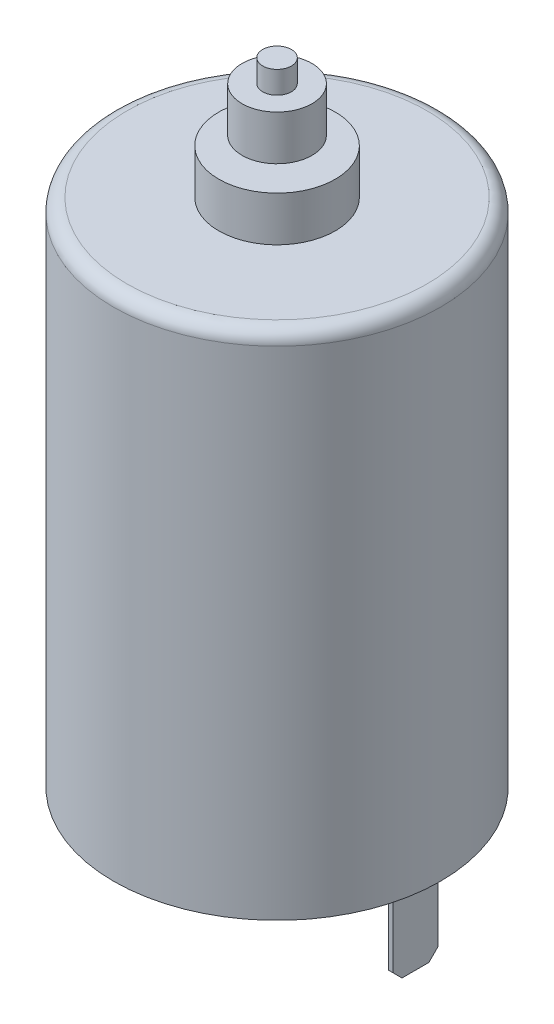
ISO-10303-21;
HEADER;
FILE_DESCRIPTION(('STEP AP214'),'2;1');
FILE_NAME('part.step','',(''),(''),'','','');
FILE_SCHEMA(('AUTOMOTIVE_DESIGN { 1 0 10303 214 1 1 1 1 }'));
ENDSEC;
DATA;
#1=APPLICATION_CONTEXT('core data for automotive mechanical design processes');
#2=APPLICATION_PROTOCOL_DEFINITION('international standard','automotive_design',2000,#1);
#3=PRODUCT_CONTEXT('',#1,'mechanical');
#4=PRODUCT('Part','Part','',(#3));
#5=PRODUCT_RELATED_PRODUCT_CATEGORY('part','',(#4));
#6=PRODUCT_DEFINITION_FORMATION('','',#4);
#7=PRODUCT_DEFINITION_CONTEXT('part definition',#1,'design');
#8=PRODUCT_DEFINITION('design','',#6,#7);
#9=PRODUCT_DEFINITION_SHAPE('','',#8);
#10=(LENGTH_UNIT() NAMED_UNIT(*) SI_UNIT(.MILLI.,.METRE.));
#11=(NAMED_UNIT(*) PLANE_ANGLE_UNIT() SI_UNIT($,.RADIAN.));
#12=(NAMED_UNIT(*) SI_UNIT($,.STERADIAN.) SOLID_ANGLE_UNIT());
#13=UNCERTAINTY_MEASURE_WITH_UNIT(LENGTH_MEASURE(1.E-05),#10,'distance_accuracy_value','');
#14=(GEOMETRIC_REPRESENTATION_CONTEXT(3) GLOBAL_UNCERTAINTY_ASSIGNED_CONTEXT((#13)) GLOBAL_UNIT_ASSIGNED_CONTEXT((#10,
#11,#12)) REPRESENTATION_CONTEXT('',''));
#15=CARTESIAN_POINT('',(0.,0.,0.));
#16=DIRECTION('',(0.,0.,1.));
#17=DIRECTION('',(1.,0.,0.));
#18=AXIS2_PLACEMENT_3D('',#15,#16,#17);
#19=CARTESIAN_POINT('',(0.,0.,0.));
#20=DIRECTION('',(0.,1.,0.));
#21=DIRECTION('',(0.,0.,1.));
#22=AXIS2_PLACEMENT_3D('',#19,#20,#21);
#23=PLANE('',#22);
#24=DIRECTION('',(0.,0.,-1.));
#25=VECTOR('',#24,1.);
#26=CARTESIAN_POINT('',(14.95,0.,2.5));
#27=LINE('',#26,#25);
#28=CARTESIAN_POINT('',(14.95,0.,2.5));
#29=VERTEX_POINT('',#28);
#30=CARTESIAN_POINT('',(14.95,0.,-2.5));
#31=VERTEX_POINT('',#30);
#32=EDGE_CURVE('E158',#29,#31,#27,.T.);
#33=ORIENTED_EDGE('',*,*,#32,.F.);
#34=DIRECTION('',(-1.,0.,0.));
#35=VECTOR('',#34,1.);
#36=CARTESIAN_POINT('',(15.45,0.,2.5));
#37=LINE('',#36,#35);
#38=CARTESIAN_POINT('',(15.45,0.,2.5));
#39=VERTEX_POINT('',#38);
#40=EDGE_CURVE('E163',#39,#29,#37,.T.);
#41=ORIENTED_EDGE('',*,*,#40,.F.);
#42=DIRECTION('',(0.,0.,1.));
#43=VECTOR('',#42,1.);
#44=CARTESIAN_POINT('',(15.45,0.,2.5));
#45=LINE('',#44,#43);
#46=CARTESIAN_POINT('',(15.45,0.,-2.5));
#47=VERTEX_POINT('',#46);
#48=EDGE_CURVE('E172',#47,#39,#45,.T.);
#49=ORIENTED_EDGE('',*,*,#48,.F.);
#50=DIRECTION('',(1.,0.,0.));
#51=VECTOR('',#50,1.);
#52=CARTESIAN_POINT('',(15.45,0.,-2.5));
#53=LINE('',#52,#51);
#54=EDGE_CURVE('E169',#31,#47,#53,.T.);
#55=ORIENTED_EDGE('',*,*,#54,.F.);
#56=EDGE_LOOP('',(#33,#41,#49,#55));
#57=FACE_BOUND('',#56,.T.);
#58=CARTESIAN_POINT('',(0.,0.,0.));
#59=DIRECTION('',(0.,-1.,0.));
#60=DIRECTION('',(0.,0.,-1.));
#61=AXIS2_PLACEMENT_3D('',#58,#59,#60);
#62=CIRCLE('',#61,5.);
#63=CARTESIAN_POINT('',(0.,0.,-5.));
#64=VERTEX_POINT('',#63);
#65=EDGE_CURVE('E192',#64,#64,#62,.T.);
#66=ORIENTED_EDGE('',*,*,#65,.F.);
#67=EDGE_LOOP('',(#66));
#68=FACE_BOUND('',#67,.T.);
#69=CARTESIAN_POINT('',(0.,0.,0.));
#70=DIRECTION('',(0.,1.,0.));
#71=DIRECTION('',(0.,0.,1.));
#72=AXIS2_PLACEMENT_3D('',#69,#70,#71);
#73=CIRCLE('',#72,18.25);
#74=CARTESIAN_POINT('',(0.,0.,18.25));
#75=VERTEX_POINT('',#74);
#76=EDGE_CURVE('E215',#75,#75,#73,.T.);
#77=ORIENTED_EDGE('',*,*,#76,.F.);
#78=EDGE_LOOP('',(#77));
#79=FACE_BOUND('',#78,.T.);
#80=DIRECTION('',(0.,0.,-1.));
#81=VECTOR('',#80,1.);
#82=CARTESIAN_POINT('',(-15.45,0.,2.5));
#83=LINE('',#82,#81);
#84=CARTESIAN_POINT('',(-15.45,0.,2.5));
#85=VERTEX_POINT('',#84);
#86=CARTESIAN_POINT('',(-15.45,0.,-2.5));
#87=VERTEX_POINT('',#86);
#88=EDGE_CURVE('E126',#85,#87,#83,.T.);
#89=ORIENTED_EDGE('',*,*,#88,.F.);
#90=DIRECTION('',(-1.,0.,0.));
#91=VECTOR('',#90,1.);
#92=CARTESIAN_POINT('',(-15.45,0.,2.5));
#93=LINE('',#92,#91);
#94=CARTESIAN_POINT('',(-14.95,0.,2.5));
#95=VERTEX_POINT('',#94);
#96=EDGE_CURVE('E138',#95,#85,#93,.T.);
#97=ORIENTED_EDGE('',*,*,#96,.F.);
#98=DIRECTION('',(0.,0.,1.));
#99=VECTOR('',#98,1.);
#100=CARTESIAN_POINT('',(-14.95,0.,2.5));
#101=LINE('',#100,#99);
#102=CARTESIAN_POINT('',(-14.95,0.,-2.5));
#103=VERTEX_POINT('',#102);
#104=EDGE_CURVE('E146',#103,#95,#101,.T.);
#105=ORIENTED_EDGE('',*,*,#104,.F.);
#106=DIRECTION('',(1.,0.,0.));
#107=VECTOR('',#106,1.);
#108=CARTESIAN_POINT('',(-15.45,0.,-2.5));
#109=LINE('',#108,#107);
#110=EDGE_CURVE('E141',#87,#103,#109,.T.);
#111=ORIENTED_EDGE('',*,*,#110,.F.);
#112=EDGE_LOOP('',(#89,#97,#105,#111));
#113=FACE_BOUND('',#112,.T.);
#114=ADVANCED_FACE('F32',(#57,#68,#79,#113),#23,.F.);
#115=CARTESIAN_POINT('',(0.,70.5,0.));
#116=DIRECTION('',(0.,-1.,0.));
#117=DIRECTION('',(0.,0.,-1.));
#118=AXIS2_PLACEMENT_3D('',#115,#116,#117);
#119=CYLINDRICAL_SURFACE('',#118,1.6);
#120=CARTESIAN_POINT('',(0.,62.,0.));
#121=DIRECTION('',(0.,1.,0.));
#122=DIRECTION('',(0.,0.,1.));
#123=AXIS2_PLACEMENT_3D('',#120,#121,#122);
#124=CIRCLE('',#123,1.6);
#125=CARTESIAN_POINT('',(0.,62.,1.6));
#126=VERTEX_POINT('',#125);
#127=EDGE_CURVE('E209',#126,#126,#124,.T.);
#128=ORIENTED_EDGE('',*,*,#127,.T.);
#129=EDGE_LOOP('',(#128));
#130=FACE_BOUND('',#129,.T.);
#131=CARTESIAN_POINT('',(0.,63.,0.));
#132=DIRECTION('',(0.,1.,0.));
#133=DIRECTION('',(0.,0.,1.));
#134=AXIS2_PLACEMENT_3D('',#131,#132,#133);
#135=CIRCLE('',#134,1.6);
#136=CARTESIAN_POINT('',(0.,63.,1.6));
#137=VERTEX_POINT('',#136);
#138=EDGE_CURVE('E198',#137,#137,#135,.T.);
#139=ORIENTED_EDGE('',*,*,#138,.F.);
#140=EDGE_LOOP('',(#139));
#141=FACE_BOUND('',#140,.T.);
#142=ADVANCED_FACE('F287',(#130,#141),#119,.T.);
#143=CARTESIAN_POINT('',(0.,57.,0.));
#144=DIRECTION('',(0.,-1.,0.));
#145=DIRECTION('',(0.,0.,-1.));
#146=AXIS2_PLACEMENT_3D('',#143,#144,#145);
#147=CYLINDRICAL_SURFACE('',#146,18.25);
#148=CARTESIAN_POINT('',(0.,55.5,0.));
#149=DIRECTION('',(0.,1.,0.));
#150=DIRECTION('',(0.,0.,1.));
#151=AXIS2_PLACEMENT_3D('',#148,#149,#150);
#152=CIRCLE('',#151,18.25);
#153=CARTESIAN_POINT('',(0.,55.5,18.25));
#154=VERTEX_POINT('',#153);
#155=EDGE_CURVE('E212',#154,#154,#152,.F.);
#156=ORIENTED_EDGE('',*,*,#155,.T.);
#157=EDGE_LOOP('',(#156));
#158=FACE_BOUND('',#157,.T.);
#159=ORIENTED_EDGE('',*,*,#76,.T.);
#160=EDGE_LOOP('',(#159));
#161=FACE_BOUND('',#160,.T.);
#162=ADVANCED_FACE('F292',(#158,#161),#147,.T.);
#163=CARTESIAN_POINT('',(0.,57.,0.));
#164=DIRECTION('',(0.,1.,0.));
#165=DIRECTION('',(0.,0.,1.));
#166=AXIS2_PLACEMENT_3D('',#163,#164,#165);
#167=PLANE('',#166);
#168=CARTESIAN_POINT('',(0.,57.,0.));
#169=DIRECTION('',(0.,1.,0.));
#170=DIRECTION('',(0.,0.,1.));
#171=AXIS2_PLACEMENT_3D('',#168,#169,#170);
#172=CIRCLE('',#171,16.75);
#173=CARTESIAN_POINT('',(0.,57.,16.75));
#174=VERTEX_POINT('',#173);
#175=EDGE_CURVE('E219',#174,#174,#172,.T.);
#176=ORIENTED_EDGE('',*,*,#175,.T.);
#177=EDGE_LOOP('',(#176));
#178=FACE_BOUND('',#177,.T.);
#179=CARTESIAN_POINT('',(0.,57.,0.));
#180=DIRECTION('',(0.,1.,0.));
#181=DIRECTION('',(0.,0.,1.));
#182=AXIS2_PLACEMENT_3D('',#179,#180,#181);
#183=CIRCLE('',#182,6.5);
#184=CARTESIAN_POINT('',(0.,57.,6.5));
#185=VERTEX_POINT('',#184);
#186=EDGE_CURVE('E216',#185,#185,#183,.T.);
#187=ORIENTED_EDGE('',*,*,#186,.F.);
#188=EDGE_LOOP('',(#187));
#189=FACE_BOUND('',#188,.T.);
#190=ADVANCED_FACE('F298',(#178,#189),#167,.T.);
#191=CARTESIAN_POINT('',(0.,62.,0.));
#192=DIRECTION('',(0.,-1.,0.));
#193=DIRECTION('',(0.,0.,-1.));
#194=AXIS2_PLACEMENT_3D('',#191,#192,#193);
#195=CYLINDRICAL_SURFACE('',#194,6.5);
#196=CARTESIAN_POINT('',(0.,62.,0.));
#197=DIRECTION('',(0.,1.,0.));
#198=DIRECTION('',(0.,0.,1.));
#199=AXIS2_PLACEMENT_3D('',#196,#197,#198);
#200=CIRCLE('',#199,6.5);
#201=CARTESIAN_POINT('',(0.,62.,6.5));
#202=VERTEX_POINT('',#201);
#203=EDGE_CURVE('E208',#202,#202,#200,.T.);
#204=ORIENTED_EDGE('',*,*,#203,.F.);
#205=EDGE_LOOP('',(#204));
#206=FACE_BOUND('',#205,.T.);
#207=ORIENTED_EDGE('',*,*,#186,.T.);
#208=EDGE_LOOP('',(#207));
#209=FACE_BOUND('',#208,.T.);
#210=ADVANCED_FACE('F386',(#206,#209),#195,.T.);
#211=CARTESIAN_POINT('',(0.,62.,0.));
#212=DIRECTION('',(0.,1.,0.));
#213=DIRECTION('',(0.,0.,1.));
#214=AXIS2_PLACEMENT_3D('',#211,#212,#213);
#215=PLANE('',#214);
#216=ORIENTED_EDGE('',*,*,#127,.F.);
#217=EDGE_LOOP('',(#216));
#218=FACE_BOUND('',#217,.T.);
#219=ORIENTED_EDGE('',*,*,#203,.T.);
#220=EDGE_LOOP('',(#219));
#221=FACE_BOUND('',#220,.T.);
#222=ADVANCED_FACE('F307',(#218,#221),#215,.T.);
#223=CARTESIAN_POINT('',(0.,55.5,0.));
#224=DIRECTION('',(0.,1.,0.));
#225=DIRECTION('',(0.,0.,1.));
#226=AXIS2_PLACEMENT_3D('',#223,#224,#225);
#227=TOROIDAL_SURFACE('',#226,16.75,1.5);
#228=ORIENTED_EDGE('',*,*,#155,.F.);
#229=EDGE_LOOP('',(#228));
#230=FACE_BOUND('',#229,.T.);
#231=ORIENTED_EDGE('',*,*,#175,.F.);
#232=EDGE_LOOP('',(#231));
#233=FACE_BOUND('',#232,.T.);
#234=ADVANCED_FACE('F303',(#230,#233),#227,.T.);
#235=CARTESIAN_POINT('',(0.,63.,0.));
#236=DIRECTION('',(0.,1.,0.));
#237=DIRECTION('',(0.,0.,1.));
#238=AXIS2_PLACEMENT_3D('',#235,#236,#237);
#239=CYLINDRICAL_SURFACE('',#238,3.9);
#240=CARTESIAN_POINT('',(0.,63.,0.));
#241=DIRECTION('',(0.,1.,0.));
#242=DIRECTION('',(0.,0.,1.));
#243=AXIS2_PLACEMENT_3D('',#240,#241,#242);
#244=CIRCLE('',#243,3.9);
#245=CARTESIAN_POINT('',(0.,63.,3.9));
#246=VERTEX_POINT('',#245);
#247=EDGE_CURVE('E199',#246,#246,#244,.T.);
#248=ORIENTED_EDGE('',*,*,#247,.T.);
#249=EDGE_LOOP('',(#248));
#250=FACE_BOUND('',#249,.T.);
#251=CARTESIAN_POINT('',(0.,68.,0.));
#252=DIRECTION('',(0.,1.,0.));
#253=DIRECTION('',(0.,0.,1.));
#254=AXIS2_PLACEMENT_3D('',#251,#252,#253);
#255=CIRCLE('',#254,3.9);
#256=CARTESIAN_POINT('',(0.,68.,3.9));
#257=VERTEX_POINT('',#256);
#258=EDGE_CURVE('E195',#257,#257,#255,.T.);
#259=ORIENTED_EDGE('',*,*,#258,.F.);
#260=EDGE_LOOP('',(#259));
#261=FACE_BOUND('',#260,.T.);
#262=ADVANCED_FACE('F306',(#250,#261),#239,.T.);
#263=CARTESIAN_POINT('',(0.,63.,0.));
#264=DIRECTION('',(0.,1.,0.));
#265=DIRECTION('',(0.,0.,1.));
#266=AXIS2_PLACEMENT_3D('',#263,#264,#265);
#267=PLANE('',#266);
#268=ORIENTED_EDGE('',*,*,#138,.T.);
#269=EDGE_LOOP('',(#268));
#270=FACE_BOUND('',#269,.T.);
#271=ORIENTED_EDGE('',*,*,#247,.F.);
#272=EDGE_LOOP('',(#271));
#273=FACE_BOUND('',#272,.T.);
#274=ADVANCED_FACE('F368',(#270,#273),#267,.F.);
#275=CARTESIAN_POINT('',(0.,68.,0.));
#276=DIRECTION('',(0.,1.,0.));
#277=DIRECTION('',(0.,0.,1.));
#278=AXIS2_PLACEMENT_3D('',#275,#276,#277);
#279=PLANE('',#278);
#280=CARTESIAN_POINT('',(0.,68.,0.));
#281=DIRECTION('',(0.,1.,0.));
#282=DIRECTION('',(0.,0.,1.));
#283=AXIS2_PLACEMENT_3D('',#280,#281,#282);
#284=CIRCLE('',#283,1.6);
#285=CARTESIAN_POINT('',(0.,68.,1.6));
#286=VERTEX_POINT('',#285);
#287=EDGE_CURVE('E202',#286,#286,#284,.T.);
#288=ORIENTED_EDGE('',*,*,#287,.F.);
#289=EDGE_LOOP('',(#288));
#290=FACE_BOUND('',#289,.T.);
#291=ORIENTED_EDGE('',*,*,#258,.T.);
#292=EDGE_LOOP('',(#291));
#293=FACE_BOUND('',#292,.T.);
#294=ADVANCED_FACE('F371',(#290,#293),#279,.T.);
#295=CARTESIAN_POINT('',(0.,70.5,0.));
#296=DIRECTION('',(0.,1.,0.));
#297=DIRECTION('',(0.,0.,1.));
#298=AXIS2_PLACEMENT_3D('',#295,#296,#297);
#299=PLANE('',#298);
#300=CARTESIAN_POINT('',(0.,70.5,0.));
#301=DIRECTION('',(0.,1.,0.));
#302=DIRECTION('',(0.,0.,1.));
#303=AXIS2_PLACEMENT_3D('',#300,#301,#302);
#304=CIRCLE('',#303,1.6);
#305=CARTESIAN_POINT('',(0.,70.5,1.6));
#306=VERTEX_POINT('',#305);
#307=EDGE_CURVE('E205',#306,#306,#304,.T.);
#308=ORIENTED_EDGE('',*,*,#307,.T.);
#309=EDGE_LOOP('',(#308));
#310=FACE_BOUND('',#309,.T.);
#311=ADVANCED_FACE('F375',(#310),#299,.T.);
#312=ORIENTED_EDGE('',*,*,#287,.T.);
#313=EDGE_LOOP('',(#312));
#314=FACE_BOUND('',#313,.T.);
#315=ORIENTED_EDGE('',*,*,#307,.F.);
#316=EDGE_LOOP('',(#315));
#317=FACE_BOUND('',#316,.T.);
#318=ADVANCED_FACE('F295',(#314,#317),#119,.T.);
#319=CARTESIAN_POINT('',(0.,-3.,0.));
#320=DIRECTION('',(0.,1.,0.));
#321=DIRECTION('',(0.,0.,1.));
#322=AXIS2_PLACEMENT_3D('',#319,#320,#321);
#323=CYLINDRICAL_SURFACE('',#322,5.);
#324=CARTESIAN_POINT('',(0.,-3.,0.));
#325=DIRECTION('',(0.,-1.,0.));
#326=DIRECTION('',(0.,0.,-1.));
#327=AXIS2_PLACEMENT_3D('',#324,#325,#326);
#328=CIRCLE('',#327,5.);
#329=CARTESIAN_POINT('',(0.,-3.,-5.));
#330=VERTEX_POINT('',#329);
#331=EDGE_CURVE('E187',#330,#330,#328,.T.);
#332=ORIENTED_EDGE('',*,*,#331,.F.);
#333=EDGE_LOOP('',(#332));
#334=FACE_BOUND('',#333,.T.);
#335=ORIENTED_EDGE('',*,*,#65,.T.);
#336=EDGE_LOOP('',(#335));
#337=FACE_BOUND('',#336,.T.);
#338=ADVANCED_FACE('F363',(#334,#337),#323,.T.);
#339=CARTESIAN_POINT('',(0.,-3.,0.));
#340=DIRECTION('',(0.,-1.,0.));
#341=DIRECTION('',(0.,0.,-1.));
#342=AXIS2_PLACEMENT_3D('',#339,#340,#341);
#343=PLANE('',#342);
#344=CARTESIAN_POINT('',(0.,-3.,0.));
#345=DIRECTION('',(0.,-1.,0.));
#346=DIRECTION('',(0.,0.,-1.));
#347=AXIS2_PLACEMENT_3D('',#344,#345,#346);
#348=CIRCLE('',#347,1.5);
#349=CARTESIAN_POINT('',(0.,-3.,-1.5));
#350=VERTEX_POINT('',#349);
#351=EDGE_CURVE('E188',#350,#350,#348,.T.);
#352=ORIENTED_EDGE('',*,*,#351,.F.);
#353=EDGE_LOOP('',(#352));
#354=FACE_BOUND('',#353,.T.);
#355=ORIENTED_EDGE('',*,*,#331,.T.);
#356=EDGE_LOOP('',(#355));
#357=FACE_BOUND('',#356,.T.);
#358=ADVANCED_FACE('F359',(#354,#357),#343,.T.);
#359=CARTESIAN_POINT('',(0.,-5.,0.));
#360=DIRECTION('',(0.,1.,0.));
#361=DIRECTION('',(0.,0.,1.));
#362=AXIS2_PLACEMENT_3D('',#359,#360,#361);
#363=CYLINDRICAL_SURFACE('',#362,1.5);
#364=CARTESIAN_POINT('',(0.,-5.,0.));
#365=DIRECTION('',(0.,-1.,0.));
#366=DIRECTION('',(0.,0.,-1.));
#367=AXIS2_PLACEMENT_3D('',#364,#365,#366);
#368=CIRCLE('',#367,1.5);
#369=CARTESIAN_POINT('',(0.,-5.,-1.5));
#370=VERTEX_POINT('',#369);
#371=EDGE_CURVE('E184',#370,#370,#368,.T.);
#372=ORIENTED_EDGE('',*,*,#371,.F.);
#373=EDGE_LOOP('',(#372));
#374=FACE_BOUND('',#373,.T.);
#375=ORIENTED_EDGE('',*,*,#351,.T.);
#376=EDGE_LOOP('',(#375));
#377=FACE_BOUND('',#376,.T.);
#378=ADVANCED_FACE('F355',(#374,#377),#363,.T.);
#379=CARTESIAN_POINT('',(0.,-5.,0.));
#380=DIRECTION('',(0.,-1.,0.));
#381=DIRECTION('',(0.,0.,-1.));
#382=AXIS2_PLACEMENT_3D('',#379,#380,#381);
#383=PLANE('',#382);
#384=ORIENTED_EDGE('',*,*,#371,.T.);
#385=EDGE_LOOP('',(#384));
#386=FACE_BOUND('',#385,.T.);
#387=ADVANCED_FACE('F352',(#386),#383,.T.);
#388=CARTESIAN_POINT('',(14.95,-10.,2.5));
#389=DIRECTION('',(1.,0.,0.));
#390=DIRECTION('',(0.,0.,-1.));
#391=AXIS2_PLACEMENT_3D('',#388,#389,#390);
#392=PLANE('',#391);
#393=DIRECTION('',(0.,0.,-1.));
#394=VECTOR('',#393,1.);
#395=CARTESIAN_POINT('',(14.95,-10.,2.5));
#396=LINE('',#395,#394);
#397=CARTESIAN_POINT('',(14.95,-10.,1.5));
#398=VERTEX_POINT('',#397);
#399=CARTESIAN_POINT('',(14.95,-10.,-1.5));
#400=VERTEX_POINT('',#399);
#401=EDGE_CURVE('E159',#398,#400,#396,.T.);
#402=ORIENTED_EDGE('',*,*,#401,.F.);
#403=DIRECTION('',(0.,-0.707106781186548,-0.707106781186548));
#404=VECTOR('',#403,1.);
#405=CARTESIAN_POINT('',(14.95,-10.,1.5));
#406=LINE('',#405,#404);
#407=CARTESIAN_POINT('',(14.95,-9.,2.5));
#408=VERTEX_POINT('',#407);
#409=EDGE_CURVE('E254',#398,#408,#406,.F.);
#410=ORIENTED_EDGE('',*,*,#409,.T.);
#411=DIRECTION('',(0.,1.,0.));
#412=VECTOR('',#411,1.);
#413=CARTESIAN_POINT('',(14.95,-10.,2.5));
#414=LINE('',#413,#412);
#415=EDGE_CURVE('E166',#408,#29,#414,.T.);
#416=ORIENTED_EDGE('',*,*,#415,.T.);
#417=ORIENTED_EDGE('',*,*,#32,.T.);
#418=DIRECTION('',(0.,1.,0.));
#419=VECTOR('',#418,1.);
#420=CARTESIAN_POINT('',(14.95,-10.,-2.5));
#421=LINE('',#420,#419);
#422=CARTESIAN_POINT('',(14.95,-9.,-2.5));
#423=VERTEX_POINT('',#422);
#424=EDGE_CURVE('E182',#423,#31,#421,.T.);
#425=ORIENTED_EDGE('',*,*,#424,.F.);
#426=DIRECTION('',(0.,0.707106781186548,-0.707106781186548));
#427=VECTOR('',#426,1.);
#428=CARTESIAN_POINT('',(14.95,-10.,-1.5));
#429=LINE('',#428,#427);
#430=EDGE_CURVE('E252',#423,#400,#429,.F.);
#431=ORIENTED_EDGE('',*,*,#430,.T.);
#432=EDGE_LOOP('',(#402,#410,#416,#417,#425,#431));
#433=FACE_BOUND('',#432,.T.);
#434=ADVANCED_FACE('F267',(#433),#392,.F.);
#435=CARTESIAN_POINT('',(15.45,-10.,-2.5));
#436=DIRECTION('',(0.,0.,1.));
#437=DIRECTION('',(1.,0.,0.));
#438=AXIS2_PLACEMENT_3D('',#435,#436,#437);
#439=PLANE('',#438);
#440=DIRECTION('',(0.,1.,0.));
#441=VECTOR('',#440,1.);
#442=CARTESIAN_POINT('',(15.45,-10.,-2.5));
#443=LINE('',#442,#441);
#444=CARTESIAN_POINT('',(15.45,-9.,-2.5));
#445=VERTEX_POINT('',#444);
#446=EDGE_CURVE('E180',#445,#47,#443,.T.);
#447=ORIENTED_EDGE('',*,*,#446,.F.);
#448=DIRECTION('',(-1.,0.,0.));
#449=VECTOR('',#448,1.);
#450=CARTESIAN_POINT('',(15.45,-9.,-2.5));
#451=LINE('',#450,#449);
#452=EDGE_CURVE('E11',#445,#423,#451,.T.);
#453=ORIENTED_EDGE('',*,*,#452,.T.);
#454=ORIENTED_EDGE('',*,*,#424,.T.);
#455=ORIENTED_EDGE('',*,*,#54,.T.);
#456=EDGE_LOOP('',(#447,#453,#454,#455));
#457=FACE_BOUND('',#456,.T.);
#458=ADVANCED_FACE('F277',(#457),#439,.F.);
#459=CARTESIAN_POINT('',(15.45,-10.,2.5));
#460=DIRECTION('',(-1.,0.,0.));
#461=DIRECTION('',(0.,0.,1.));
#462=AXIS2_PLACEMENT_3D('',#459,#460,#461);
#463=PLANE('',#462);
#464=DIRECTION('',(0.,1.,0.));
#465=VECTOR('',#464,1.);
#466=CARTESIAN_POINT('',(15.45,-10.,2.5));
#467=LINE('',#466,#465);
#468=CARTESIAN_POINT('',(15.45,-9.,2.5));
#469=VERTEX_POINT('',#468);
#470=EDGE_CURVE('E178',#469,#39,#467,.T.);
#471=ORIENTED_EDGE('',*,*,#470,.F.);
#472=DIRECTION('',(0.,0.707106781186548,0.707106781186548));
#473=VECTOR('',#472,1.);
#474=CARTESIAN_POINT('',(15.45,-10.,1.5));
#475=LINE('',#474,#473);
#476=CARTESIAN_POINT('',(15.45,-10.,1.5));
#477=VERTEX_POINT('',#476);
#478=EDGE_CURVE('E40',#469,#477,#475,.F.);
#479=ORIENTED_EDGE('',*,*,#478,.T.);
#480=DIRECTION('',(0.,0.,1.));
#481=VECTOR('',#480,1.);
#482=CARTESIAN_POINT('',(15.45,-10.,2.5));
#483=LINE('',#482,#481);
#484=CARTESIAN_POINT('',(15.45,-10.,-1.5));
#485=VERTEX_POINT('',#484);
#486=EDGE_CURVE('E162',#485,#477,#483,.T.);
#487=ORIENTED_EDGE('',*,*,#486,.F.);
#488=DIRECTION('',(0.,-0.707106781186548,0.707106781186548));
#489=VECTOR('',#488,1.);
#490=CARTESIAN_POINT('',(15.45,-10.,-1.5));
#491=LINE('',#490,#489);
#492=EDGE_CURVE('E47',#485,#445,#491,.F.);
#493=ORIENTED_EDGE('',*,*,#492,.T.);
#494=ORIENTED_EDGE('',*,*,#446,.T.);
#495=ORIENTED_EDGE('',*,*,#48,.T.);
#496=EDGE_LOOP('',(#471,#479,#487,#493,#494,#495));
#497=FACE_BOUND('',#496,.T.);
#498=ADVANCED_FACE('F258',(#497),#463,.F.);
#499=CARTESIAN_POINT('',(15.45,-10.,2.5));
#500=DIRECTION('',(0.,0.,-1.));
#501=DIRECTION('',(-1.,0.,0.));
#502=AXIS2_PLACEMENT_3D('',#499,#500,#501);
#503=PLANE('',#502);
#504=ORIENTED_EDGE('',*,*,#415,.F.);
#505=DIRECTION('',(1.,0.,0.));
#506=VECTOR('',#505,1.);
#507=CARTESIAN_POINT('',(15.45,-9.,2.5));
#508=LINE('',#507,#506);
#509=EDGE_CURVE('E55',#408,#469,#508,.T.);
#510=ORIENTED_EDGE('',*,*,#509,.T.);
#511=ORIENTED_EDGE('',*,*,#470,.T.);
#512=ORIENTED_EDGE('',*,*,#40,.T.);
#513=EDGE_LOOP('',(#504,#510,#511,#512));
#514=FACE_BOUND('',#513,.T.);
#515=ADVANCED_FACE('F269',(#514),#503,.F.);
#516=CARTESIAN_POINT('',(0.,-10.,0.));
#517=DIRECTION('',(0.,1.,0.));
#518=DIRECTION('',(0.,0.,1.));
#519=AXIS2_PLACEMENT_3D('',#516,#517,#518);
#520=PLANE('',#519);
#521=ORIENTED_EDGE('',*,*,#486,.T.);
#522=DIRECTION('',(-1.,0.,0.));
#523=VECTOR('',#522,1.);
#524=CARTESIAN_POINT('',(0.,-10.,1.5));
#525=LINE('',#524,#523);
#526=EDGE_CURVE('E249',#477,#398,#525,.T.);
#527=ORIENTED_EDGE('',*,*,#526,.T.);
#528=ORIENTED_EDGE('',*,*,#401,.T.);
#529=DIRECTION('',(1.,0.,0.));
#530=VECTOR('',#529,1.);
#531=CARTESIAN_POINT('',(0.,-10.,-1.5));
#532=LINE('',#531,#530);
#533=EDGE_CURVE('E246',#400,#485,#532,.T.);
#534=ORIENTED_EDGE('',*,*,#533,.T.);
#535=EDGE_LOOP('',(#521,#527,#528,#534));
#536=FACE_BOUND('',#535,.T.);
#537=ADVANCED_FACE('F262',(#536),#520,.F.);
#538=CARTESIAN_POINT('',(-15.45,-10.,2.5));
#539=DIRECTION('',(1.,0.,0.));
#540=DIRECTION('',(0.,0.,-1.));
#541=AXIS2_PLACEMENT_3D('',#538,#539,#540);
#542=PLANE('',#541);
#543=DIRECTION('',(0.,0.,-1.));
#544=VECTOR('',#543,1.);
#545=CARTESIAN_POINT('',(-15.45,-10.,2.5));
#546=LINE('',#545,#544);
#547=CARTESIAN_POINT('',(-15.45,-10.,1.5));
#548=VERTEX_POINT('',#547);
#549=CARTESIAN_POINT('',(-15.45,-10.,-1.49999999999998));
#550=VERTEX_POINT('',#549);
#551=EDGE_CURVE('E145',#548,#550,#546,.T.);
#552=ORIENTED_EDGE('',*,*,#551,.F.);
#553=DIRECTION('',(0.,0.707106781186548,0.707106781186548));
#554=VECTOR('',#553,1.);
#555=CARTESIAN_POINT('',(-15.45,-10.,1.5));
#556=LINE('',#555,#554);
#557=CARTESIAN_POINT('',(-15.45,-9.,2.5));
#558=VERTEX_POINT('',#557);
#559=EDGE_CURVE('E127',#548,#558,#556,.T.);
#560=ORIENTED_EDGE('',*,*,#559,.T.);
#561=DIRECTION('',(0.,1.,0.));
#562=VECTOR('',#561,1.);
#563=CARTESIAN_POINT('',(-15.45,-10.,2.5));
#564=LINE('',#563,#562);
#565=EDGE_CURVE('E121',#558,#85,#564,.T.);
#566=ORIENTED_EDGE('',*,*,#565,.T.);
#567=ORIENTED_EDGE('',*,*,#88,.T.);
#568=DIRECTION('',(0.,1.,0.));
#569=VECTOR('',#568,1.);
#570=CARTESIAN_POINT('',(-15.45,-10.,-2.5));
#571=LINE('',#570,#569);
#572=CARTESIAN_POINT('',(-15.45,-8.99999999999999,-2.5));
#573=VERTEX_POINT('',#572);
#574=EDGE_CURVE('E156',#573,#87,#571,.T.);
#575=ORIENTED_EDGE('',*,*,#574,.F.);
#576=DIRECTION('',(0.,-0.707106781186548,0.707106781186548));
#577=VECTOR('',#576,1.);
#578=CARTESIAN_POINT('',(-15.45,-10.,-1.49999999999998));
#579=LINE('',#578,#577);
#580=EDGE_CURVE('E235',#573,#550,#579,.T.);
#581=ORIENTED_EDGE('',*,*,#580,.T.);
#582=EDGE_LOOP('',(#552,#560,#566,#567,#575,#581));
#583=FACE_BOUND('',#582,.T.);
#584=ADVANCED_FACE('F124',(#583),#542,.F.);
#585=CARTESIAN_POINT('',(-15.45,-10.,-2.5));
#586=DIRECTION('',(0.,0.,1.));
#587=DIRECTION('',(1.,0.,0.));
#588=AXIS2_PLACEMENT_3D('',#585,#586,#587);
#589=PLANE('',#588);
#590=DIRECTION('',(0.,1.,0.));
#591=VECTOR('',#590,1.);
#592=CARTESIAN_POINT('',(-14.95,-10.,-2.5));
#593=LINE('',#592,#591);
#594=CARTESIAN_POINT('',(-14.95,-8.99999999999999,-2.5));
#595=VERTEX_POINT('',#594);
#596=EDGE_CURVE('E154',#595,#103,#593,.T.);
#597=ORIENTED_EDGE('',*,*,#596,.F.);
#598=DIRECTION('',(-1.,0.,0.));
#599=VECTOR('',#598,1.);
#600=CARTESIAN_POINT('',(-15.45,-8.99999999999999,-2.5));
#601=LINE('',#600,#599);
#602=EDGE_CURVE('E244',#595,#573,#601,.T.);
#603=ORIENTED_EDGE('',*,*,#602,.T.);
#604=ORIENTED_EDGE('',*,*,#574,.T.);
#605=ORIENTED_EDGE('',*,*,#110,.T.);
#606=EDGE_LOOP('',(#597,#603,#604,#605));
#607=FACE_BOUND('',#606,.T.);
#608=ADVANCED_FACE('F330',(#607),#589,.F.);
#609=CARTESIAN_POINT('',(-14.95,-10.,2.5));
#610=DIRECTION('',(-1.,0.,0.));
#611=DIRECTION('',(0.,0.,1.));
#612=AXIS2_PLACEMENT_3D('',#609,#610,#611);
#613=PLANE('',#612);
#614=DIRECTION('',(0.,1.,0.));
#615=VECTOR('',#614,1.);
#616=CARTESIAN_POINT('',(-14.95,-10.,2.5));
#617=LINE('',#616,#615);
#618=CARTESIAN_POINT('',(-14.95,-9.,2.5));
#619=VERTEX_POINT('',#618);
#620=EDGE_CURVE('E131',#619,#95,#617,.T.);
#621=ORIENTED_EDGE('',*,*,#620,.F.);
#622=DIRECTION('',(0.,-0.707106781186548,-0.707106781186548));
#623=VECTOR('',#622,1.);
#624=CARTESIAN_POINT('',(-14.95,-10.,1.5));
#625=LINE('',#624,#623);
#626=CARTESIAN_POINT('',(-14.95,-10.,1.5));
#627=VERTEX_POINT('',#626);
#628=EDGE_CURVE('E242',#619,#627,#625,.T.);
#629=ORIENTED_EDGE('',*,*,#628,.T.);
#630=DIRECTION('',(0.,0.,1.));
#631=VECTOR('',#630,1.);
#632=CARTESIAN_POINT('',(-14.95,-10.,2.5));
#633=LINE('',#632,#631);
#634=CARTESIAN_POINT('',(-14.95,-10.,-1.49999999999998));
#635=VERTEX_POINT('',#634);
#636=EDGE_CURVE('E132',#635,#627,#633,.T.);
#637=ORIENTED_EDGE('',*,*,#636,.F.);
#638=DIRECTION('',(0.,0.707106781186548,-0.707106781186548));
#639=VECTOR('',#638,1.);
#640=CARTESIAN_POINT('',(-14.95,-10.,-1.49999999999998));
#641=LINE('',#640,#639);
#642=EDGE_CURVE('E240',#635,#595,#641,.T.);
#643=ORIENTED_EDGE('',*,*,#642,.T.);
#644=ORIENTED_EDGE('',*,*,#596,.T.);
#645=ORIENTED_EDGE('',*,*,#104,.T.);
#646=EDGE_LOOP('',(#621,#629,#637,#643,#644,#645));
#647=FACE_BOUND('',#646,.T.);
#648=ADVANCED_FACE('F327',(#647),#613,.F.);
#649=CARTESIAN_POINT('',(-15.45,-10.,2.5));
#650=DIRECTION('',(0.,0.,-1.));
#651=DIRECTION('',(-1.,0.,0.));
#652=AXIS2_PLACEMENT_3D('',#649,#650,#651);
#653=PLANE('',#652);
#654=ORIENTED_EDGE('',*,*,#565,.F.);
#655=DIRECTION('',(1.,0.,0.));
#656=VECTOR('',#655,1.);
#657=CARTESIAN_POINT('',(-14.95,-9.,2.5));
#658=LINE('',#657,#656);
#659=EDGE_CURVE('E238',#558,#619,#658,.T.);
#660=ORIENTED_EDGE('',*,*,#659,.T.);
#661=ORIENTED_EDGE('',*,*,#620,.T.);
#662=ORIENTED_EDGE('',*,*,#96,.T.);
#663=EDGE_LOOP('',(#654,#660,#661,#662));
#664=FACE_BOUND('',#663,.T.);
#665=ADVANCED_FACE('F143',(#664),#653,.F.);
#666=CARTESIAN_POINT('',(0.,-10.,0.));
#667=DIRECTION('',(0.,-1.,0.));
#668=DIRECTION('',(0.,0.,-1.));
#669=AXIS2_PLACEMENT_3D('',#666,#667,#668);
#670=PLANE('',#669);
#671=ORIENTED_EDGE('',*,*,#636,.T.);
#672=DIRECTION('',(-1.,0.,0.));
#673=VECTOR('',#672,1.);
#674=CARTESIAN_POINT('',(-15.45,-10.,1.5));
#675=LINE('',#674,#673);
#676=EDGE_CURVE('E232',#627,#548,#675,.T.);
#677=ORIENTED_EDGE('',*,*,#676,.T.);
#678=ORIENTED_EDGE('',*,*,#551,.T.);
#679=DIRECTION('',(1.,0.,0.));
#680=VECTOR('',#679,1.);
#681=CARTESIAN_POINT('',(-14.95,-10.,-1.49999999999998));
#682=LINE('',#681,#680);
#683=EDGE_CURVE('E191',#550,#635,#682,.T.);
#684=ORIENTED_EDGE('',*,*,#683,.T.);
#685=EDGE_LOOP('',(#671,#677,#678,#684));
#686=FACE_BOUND('',#685,.T.);
#687=ADVANCED_FACE('F312',(#686),#670,.T.);
#688=CARTESIAN_POINT('',(0.,-10.,1.5));
#689=DIRECTION('',(0.,-0.707106781186547,0.707106781186547));
#690=DIRECTION('',(1.,0.,0.));
#691=AXIS2_PLACEMENT_3D('',#688,#689,#690);
#692=PLANE('',#691);
#693=ORIENTED_EDGE('',*,*,#628,.F.);
#694=ORIENTED_EDGE('',*,*,#659,.F.);
#695=ORIENTED_EDGE('',*,*,#559,.F.);
#696=ORIENTED_EDGE('',*,*,#676,.F.);
#697=EDGE_LOOP('',(#693,#694,#695,#696));
#698=FACE_BOUND('',#697,.T.);
#699=ADVANCED_FACE('F309',(#698),#692,.T.);
#700=CARTESIAN_POINT('',(0.,-10.,-1.49999999999998));
#701=DIRECTION('',(0.,-0.707106781186547,-0.707106781186547));
#702=DIRECTION('',(-1.,0.,0.));
#703=AXIS2_PLACEMENT_3D('',#700,#701,#702);
#704=PLANE('',#703);
#705=ORIENTED_EDGE('',*,*,#580,.F.);
#706=ORIENTED_EDGE('',*,*,#602,.F.);
#707=ORIENTED_EDGE('',*,*,#642,.F.);
#708=ORIENTED_EDGE('',*,*,#683,.F.);
#709=EDGE_LOOP('',(#705,#706,#707,#708));
#710=FACE_BOUND('',#709,.T.);
#711=ADVANCED_FACE('F285',(#710),#704,.T.);
#712=CARTESIAN_POINT('',(0.,-10.,1.5));
#713=DIRECTION('',(0.,0.707106781186547,-0.707106781186547));
#714=DIRECTION('',(-1.,0.,0.));
#715=AXIS2_PLACEMENT_3D('',#712,#713,#714);
#716=PLANE('',#715);
#717=ORIENTED_EDGE('',*,*,#478,.F.);
#718=ORIENTED_EDGE('',*,*,#509,.F.);
#719=ORIENTED_EDGE('',*,*,#409,.F.);
#720=ORIENTED_EDGE('',*,*,#526,.F.);
#721=EDGE_LOOP('',(#717,#718,#719,#720));
#722=FACE_BOUND('',#721,.T.);
#723=ADVANCED_FACE('F265',(#722),#716,.F.);
#724=CARTESIAN_POINT('',(0.,-10.,-1.5));
#725=DIRECTION('',(0.,0.707106781186547,0.707106781186547));
#726=DIRECTION('',(1.,0.,0.));
#727=AXIS2_PLACEMENT_3D('',#724,#725,#726);
#728=PLANE('',#727);
#729=ORIENTED_EDGE('',*,*,#430,.F.);
#730=ORIENTED_EDGE('',*,*,#452,.F.);
#731=ORIENTED_EDGE('',*,*,#492,.F.);
#732=ORIENTED_EDGE('',*,*,#533,.F.);
#733=EDGE_LOOP('',(#729,#730,#731,#732));
#734=FACE_BOUND('',#733,.T.);
#735=ADVANCED_FACE('F34',(#734),#728,.F.);
#736=CLOSED_SHELL('',(#114,#142,#162,#190,#210,#222,#234,#262,#274,#294,#311,#318,#338,#358,
#378,#387,#434,#458,#498,#515,#537,#584,#608,#648,#665,#687,#699,#711,#723,#735));
#737=MANIFOLD_SOLID_BREP('B2',#736);
#738=ADVANCED_BREP_SHAPE_REPRESENTATION('',(#18,#737),#14);
#739=SHAPE_DEFINITION_REPRESENTATION(#9,#738);
ENDSEC;
END-ISO-10303-21;
